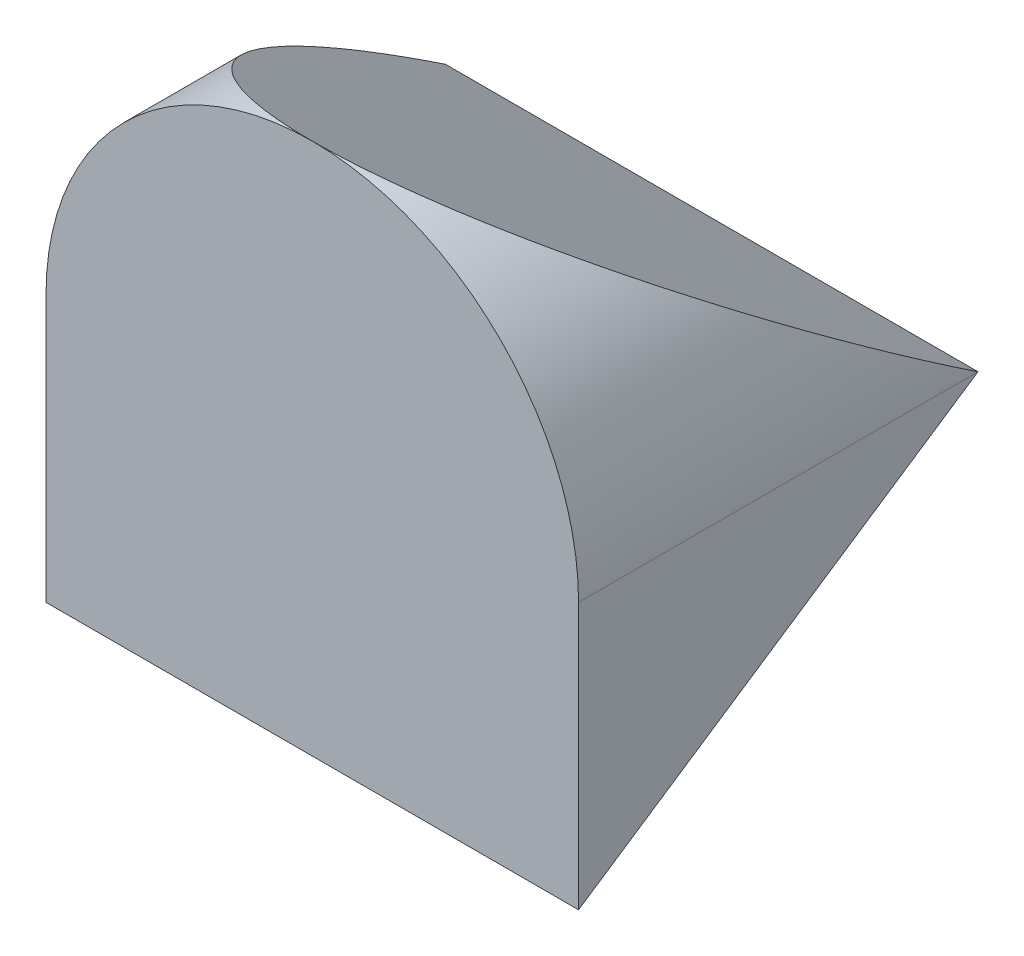
ISO-10303-21;
HEADER;
FILE_DESCRIPTION(('STEP AP214'),'2;1');
FILE_NAME('part.step','',(''),(''),'','','');
FILE_SCHEMA(('AUTOMOTIVE_DESIGN { 1 0 10303 214 1 1 1 1 }'));
ENDSEC;
DATA;
#1=APPLICATION_CONTEXT('core data for automotive mechanical design processes');
#2=APPLICATION_PROTOCOL_DEFINITION('international standard','automotive_design',2000,#1);
#3=PRODUCT_CONTEXT('',#1,'mechanical');
#4=PRODUCT('Part','Part','',(#3));
#5=PRODUCT_RELATED_PRODUCT_CATEGORY('part','',(#4));
#6=PRODUCT_DEFINITION_FORMATION('','',#4);
#7=PRODUCT_DEFINITION_CONTEXT('part definition',#1,'design');
#8=PRODUCT_DEFINITION('design','',#6,#7);
#9=PRODUCT_DEFINITION_SHAPE('','',#8);
#10=(LENGTH_UNIT() NAMED_UNIT(*) SI_UNIT(.MILLI.,.METRE.));
#11=(NAMED_UNIT(*) PLANE_ANGLE_UNIT() SI_UNIT($,.RADIAN.));
#12=(NAMED_UNIT(*) SI_UNIT($,.STERADIAN.) SOLID_ANGLE_UNIT());
#13=UNCERTAINTY_MEASURE_WITH_UNIT(LENGTH_MEASURE(1.E-05),#10,'distance_accuracy_value','');
#14=(GEOMETRIC_REPRESENTATION_CONTEXT(3) GLOBAL_UNCERTAINTY_ASSIGNED_CONTEXT((#13)) GLOBAL_UNIT_ASSIGNED_CONTEXT((#10,
#11,#12)) REPRESENTATION_CONTEXT('',''));
#15=CARTESIAN_POINT('',(0.,0.,0.));
#16=DIRECTION('',(0.,0.,1.));
#17=DIRECTION('',(1.,0.,0.));
#18=AXIS2_PLACEMENT_3D('',#15,#16,#17);
#19=CARTESIAN_POINT('',(0.,0.,15.));
#20=DIRECTION('',(0.,0.,-1.));
#21=DIRECTION('',(-1.,0.,0.));
#22=AXIS2_PLACEMENT_3D('',#19,#20,#21);
#23=CYLINDRICAL_SURFACE('',#22,10.);
#24=DIRECTION('',(0.,0.,1.));
#25=VECTOR('',#24,1.);
#26=CARTESIAN_POINT('',(-10.,0.,0.));
#27=LINE('',#26,#25);
#28=CARTESIAN_POINT('',(-10.,0.,0.));
#29=VERTEX_POINT('',#28);
#30=CARTESIAN_POINT('',(-10.,0.,15.));
#31=VERTEX_POINT('',#30);
#32=EDGE_CURVE('E48',#29,#31,#27,.T.);
#33=ORIENTED_EDGE('',*,*,#32,.T.);
#34=CARTESIAN_POINT('',(0.,0.,15.));
#35=DIRECTION('',(0.,0.,1.));
#36=DIRECTION('',(1.,0.,0.));
#37=AXIS2_PLACEMENT_3D('',#34,#35,#36);
#38=CIRCLE('',#37,10.);
#39=CARTESIAN_POINT('',(0.,10.,15.));
#40=VERTEX_POINT('',#39);
#41=EDGE_CURVE('E41',#40,#31,#38,.T.);
#42=ORIENTED_EDGE('',*,*,#41,.F.);
#43=CARTESIAN_POINT('',(0.,0.,0.));
#44=DIRECTION('',(0.,-0.832050294337844,0.554700196225229));
#45=DIRECTION('',(0.,-0.554700196225229,-0.832050294337844));
#46=AXIS2_PLACEMENT_3D('',#43,#44,#45);
#47=ELLIPSE('',#46,18.0277563773199,10.);
#48=EDGE_CURVE('E87',#40,#29,#47,.T.);
#49=ORIENTED_EDGE('',*,*,#48,.T.);
#50=EDGE_LOOP('',(#33,#42,#49));
#51=FACE_BOUND('',#50,.T.);
#52=ADVANCED_FACE('F33',(#51),#23,.T.);
#53=DIRECTION('',(0.,0.,1.));
#54=VECTOR('',#53,1.);
#55=CARTESIAN_POINT('',(10.,0.,0.));
#56=LINE('',#55,#54);
#57=CARTESIAN_POINT('',(10.,0.,0.));
#58=VERTEX_POINT('',#57);
#59=CARTESIAN_POINT('',(10.,0.,15.));
#60=VERTEX_POINT('',#59);
#61=EDGE_CURVE('E89',#58,#60,#56,.T.);
#62=ORIENTED_EDGE('',*,*,#61,.F.);
#63=CARTESIAN_POINT('',(0.,0.,0.));
#64=DIRECTION('',(0.,-0.832050294337844,0.554700196225229));
#65=DIRECTION('',(0.,-0.554700196225229,-0.832050294337844));
#66=AXIS2_PLACEMENT_3D('',#63,#64,#65);
#67=ELLIPSE('',#66,18.0277563773199,10.);
#68=EDGE_CURVE('E88',#58,#40,#67,.T.);
#69=ORIENTED_EDGE('',*,*,#68,.T.);
#70=EDGE_CURVE('E11',#60,#40,#38,.T.);
#71=ORIENTED_EDGE('',*,*,#70,.F.);
#72=EDGE_LOOP('',(#62,#69,#71));
#73=FACE_BOUND('',#72,.T.);
#74=ADVANCED_FACE('F35',(#73),#23,.T.);
#75=CARTESIAN_POINT('',(0.,0.,15.));
#76=DIRECTION('',(0.,0.,1.));
#77=DIRECTION('',(1.,0.,0.));
#78=AXIS2_PLACEMENT_3D('',#75,#76,#77);
#79=PLANE('',#78);
#80=ORIENTED_EDGE('',*,*,#41,.T.);
#81=DIRECTION('',(0.,-1.,0.));
#82=VECTOR('',#81,1.);
#83=CARTESIAN_POINT('',(-10.,0.,15.));
#84=LINE('',#83,#82);
#85=CARTESIAN_POINT('',(-10.,-10.,15.));
#86=VERTEX_POINT('',#85);
#87=EDGE_CURVE('E93',#31,#86,#84,.T.);
#88=ORIENTED_EDGE('',*,*,#87,.T.);
#89=DIRECTION('',(-1.,0.,0.));
#90=VECTOR('',#89,1.);
#91=CARTESIAN_POINT('',(10.,-10.,15.));
#92=LINE('',#91,#90);
#93=CARTESIAN_POINT('',(10.,-10.,15.));
#94=VERTEX_POINT('',#93);
#95=EDGE_CURVE('E78',#94,#86,#92,.T.);
#96=ORIENTED_EDGE('',*,*,#95,.F.);
#97=DIRECTION('',(0.,-1.,0.));
#98=VECTOR('',#97,1.);
#99=CARTESIAN_POINT('',(10.,0.,15.));
#100=LINE('',#99,#98);
#101=EDGE_CURVE('E95',#60,#94,#100,.T.);
#102=ORIENTED_EDGE('',*,*,#101,.F.);
#103=ORIENTED_EDGE('',*,*,#70,.T.);
#104=EDGE_LOOP('',(#80,#88,#96,#102,#103));
#105=FACE_BOUND('',#104,.T.);
#106=ADVANCED_FACE('F105',(#105),#79,.T.);
#107=CARTESIAN_POINT('',(0.,10.,15.));
#108=DIRECTION('',(0.,-0.832050294337844,0.554700196225229));
#109=DIRECTION('',(0.,-0.554700196225229,-0.832050294337844));
#110=AXIS2_PLACEMENT_3D('',#107,#108,#109);
#111=PLANE('',#110);
#112=DIRECTION('',(1.,0.,0.));
#113=VECTOR('',#112,1.);
#114=CARTESIAN_POINT('',(0.,0.,0.));
#115=LINE('',#114,#113);
#116=EDGE_CURVE('E75',#29,#58,#115,.T.);
#117=ORIENTED_EDGE('',*,*,#116,.F.);
#118=ORIENTED_EDGE('',*,*,#48,.F.);
#119=ORIENTED_EDGE('',*,*,#68,.F.);
#120=EDGE_LOOP('',(#117,#118,#119));
#121=FACE_BOUND('',#120,.T.);
#122=ADVANCED_FACE('F86',(#121),#111,.F.);
#123=CARTESIAN_POINT('',(10.,0.,0.));
#124=DIRECTION('',(-1.,0.,0.));
#125=DIRECTION('',(0.,0.,1.));
#126=AXIS2_PLACEMENT_3D('',#123,#124,#125);
#127=PLANE('',#126);
#128=ORIENTED_EDGE('',*,*,#101,.T.);
#129=DIRECTION('',(0.,-0.554700196225229,0.832050294337844));
#130=VECTOR('',#129,1.);
#131=CARTESIAN_POINT('',(10.,0.,0.));
#132=LINE('',#131,#130);
#133=EDGE_CURVE('E82',#58,#94,#132,.T.);
#134=ORIENTED_EDGE('',*,*,#133,.F.);
#135=ORIENTED_EDGE('',*,*,#61,.T.);
#136=EDGE_LOOP('',(#128,#134,#135));
#137=FACE_BOUND('',#136,.T.);
#138=ADVANCED_FACE('F106',(#137),#127,.F.);
#139=CARTESIAN_POINT('',(-10.,0.,0.));
#140=DIRECTION('',(-1.,0.,0.));
#141=DIRECTION('',(0.,0.,1.));
#142=AXIS2_PLACEMENT_3D('',#139,#140,#141);
#143=PLANE('',#142);
#144=DIRECTION('',(0.,-0.554700196225229,0.832050294337844));
#145=VECTOR('',#144,1.);
#146=CARTESIAN_POINT('',(-10.,0.,0.));
#147=LINE('',#146,#145);
#148=EDGE_CURVE('E72',#29,#86,#147,.T.);
#149=ORIENTED_EDGE('',*,*,#148,.T.);
#150=ORIENTED_EDGE('',*,*,#87,.F.);
#151=ORIENTED_EDGE('',*,*,#32,.F.);
#152=EDGE_LOOP('',(#149,#150,#151));
#153=FACE_BOUND('',#152,.T.);
#154=ADVANCED_FACE('F92',(#153),#143,.T.);
#155=CARTESIAN_POINT('',(-10.,0.,0.));
#156=DIRECTION('',(0.,0.832050294337844,0.554700196225229));
#157=DIRECTION('',(0.,-0.554700196225229,0.832050294337844));
#158=AXIS2_PLACEMENT_3D('',#155,#156,#157);
#159=PLANE('',#158);
#160=ORIENTED_EDGE('',*,*,#133,.T.);
#161=ORIENTED_EDGE('',*,*,#95,.T.);
#162=ORIENTED_EDGE('',*,*,#148,.F.);
#163=ORIENTED_EDGE('',*,*,#116,.T.);
#164=EDGE_LOOP('',(#160,#161,#162,#163));
#165=FACE_BOUND('',#164,.T.);
#166=ADVANCED_FACE('F74',(#165),#159,.F.);
#167=CLOSED_SHELL('',(#52,#74,#106,#122,#138,#154,#166));
#168=MANIFOLD_SOLID_BREP('B2',#167);
#169=ADVANCED_BREP_SHAPE_REPRESENTATION('',(#18,#168),#14);
#170=SHAPE_DEFINITION_REPRESENTATION(#9,#169);
ENDSEC;
END-ISO-10303-21;
